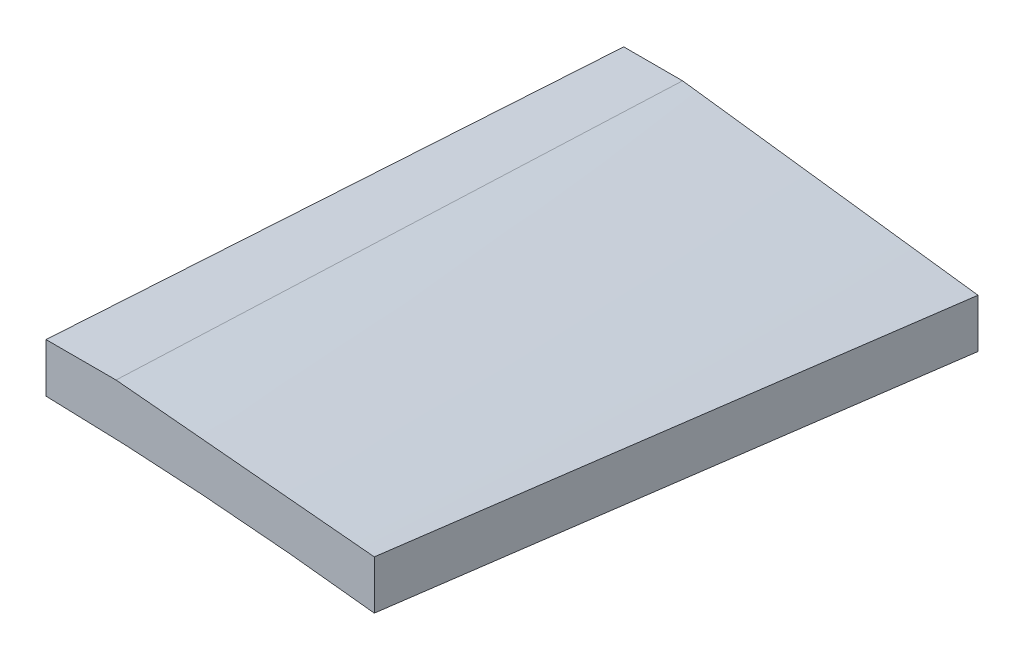
ISO-10303-21;
HEADER;
FILE_DESCRIPTION(('STEP AP214'),'2;1');
FILE_NAME('part.step','',(''),(''),'','','');
FILE_SCHEMA(('AUTOMOTIVE_DESIGN { 1 0 10303 214 1 1 1 1 }'));
ENDSEC;
DATA;
#1=APPLICATION_CONTEXT('core data for automotive mechanical design processes');
#2=APPLICATION_PROTOCOL_DEFINITION('international standard','automotive_design',2000,#1);
#3=PRODUCT_CONTEXT('',#1,'mechanical');
#4=PRODUCT('Part','Part','',(#3));
#5=PRODUCT_RELATED_PRODUCT_CATEGORY('part','',(#4));
#6=PRODUCT_DEFINITION_FORMATION('','',#4);
#7=PRODUCT_DEFINITION_CONTEXT('part definition',#1,'design');
#8=PRODUCT_DEFINITION('design','',#6,#7);
#9=PRODUCT_DEFINITION_SHAPE('','',#8);
#10=(LENGTH_UNIT() NAMED_UNIT(*) SI_UNIT(.MILLI.,.METRE.));
#11=(NAMED_UNIT(*) PLANE_ANGLE_UNIT() SI_UNIT($,.RADIAN.));
#12=(NAMED_UNIT(*) SI_UNIT($,.STERADIAN.) SOLID_ANGLE_UNIT());
#13=UNCERTAINTY_MEASURE_WITH_UNIT(LENGTH_MEASURE(1.E-05),#10,'distance_accuracy_value','');
#14=(GEOMETRIC_REPRESENTATION_CONTEXT(3) GLOBAL_UNCERTAINTY_ASSIGNED_CONTEXT((#13)) GLOBAL_UNIT_ASSIGNED_CONTEXT((#10,
#11,#12)) REPRESENTATION_CONTEXT('',''));
#15=CARTESIAN_POINT('',(0.,0.,0.));
#16=DIRECTION('',(0.,0.,1.));
#17=DIRECTION('',(1.,0.,0.));
#18=AXIS2_PLACEMENT_3D('',#15,#16,#17);
#19=CARTESIAN_POINT('',(122.012987748225,6.34998004884585,335.28));
#20=DIRECTION('',(1.,0.,0.));
#21=DIRECTION('',(0.,1.,0.));
#22=AXIS2_PLACEMENT_3D('',#19,#20,#21);
#23=PLANE('',#22);
#24=CARTESIAN_POINT('',(122.012987748225,42.2689138855518,619.759999999985));
#25=CARTESIAN_POINT('',(122.012987748225,43.0449286767758,631.613383838207));
#26=CARTESIAN_POINT('',(122.012987748225,43.8211244635662,643.466755827629));
#27=CARTESIAN_POINT('',(122.012987748225,45.373895579959,667.173474933267));
#28=CARTESIAN_POINT('',(122.012987748225,46.150470909561,679.026822049482));
#29=CARTESIAN_POINT('',(122.012987748225,47.7040186650179,702.733490260003));
#30=CARTESIAN_POINT('',(122.012987748225,48.4809910908729,714.586811354309));
#31=CARTESIAN_POINT('',(122.012987748225,50.0353507213848,738.293426360589));
#32=CARTESIAN_POINT('',(122.012987748225,50.8127379260422,750.146720272562));
#33=CARTESIAN_POINT('',(122.012987748225,51.5903413605131,762.));
#34=B_SPLINE_CURVE_WITH_KNOTS('',3,(#24,#25,#26,#27,#28,#29,#30,#31,#32,#33),.UNSPECIFIED.,.F.,
.F.,(4,2,2,2,4),(0.,35.6362759882764,71.2725519365494,106.90882788571,142.545103874873),.UNSPECIFIED.);
#35=CARTESIAN_POINT('',(122.012987748225,42.2689138855518,619.759999999985));
#36=VERTEX_POINT('',#35);
#37=CARTESIAN_POINT('',(122.012985594409,51.5902087951168,762.));
#38=VERTEX_POINT('',#37);
#39=EDGE_CURVE('E104',#36,#38,#34,.T.);
#40=ORIENTED_EDGE('',*,*,#39,.T.);
#41=DIRECTION('',(0.,1.,0.));
#42=VECTOR('',#41,1.);
#43=CARTESIAN_POINT('',(122.012987748225,51.6460530017887,762.));
#44=LINE('',#43,#42);
#45=CARTESIAN_POINT('',(122.012987748225,63.6548897190744,762.));
#46=VERTEX_POINT('',#45);
#47=EDGE_CURVE('E107',#38,#46,#44,.T.);
#48=ORIENTED_EDGE('',*,*,#47,.T.);
#49=CARTESIAN_POINT('',(122.012987748225,63.6548897190743,761.999999999999));
#50=CARTESIAN_POINT('',(122.012987748225,62.6352649018501,745.364551576616));
#51=CARTESIAN_POINT('',(122.012987748225,61.6160439518045,728.729078401939));
#52=CARTESIAN_POINT('',(122.012987748225,59.5783642213013,695.458085396377));
#53=CARTESIAN_POINT('',(122.012987748225,58.5599054408426,678.822565565492));
#54=CARTESIAN_POINT('',(122.012987748225,56.6762901019862,648.044698096347));
#55=CARTESIAN_POINT('',(122.012987748225,55.811034192517,633.902356538365));
#56=CARTESIAN_POINT('',(122.012987748225,54.9460232350253,619.759999999985));
#57=B_SPLINE_CURVE_WITH_KNOTS('',3,(#49,#50,#51,#52,#53,#54,#55,#56),.UNSPECIFIED.,.F.,.F.,(4,2,
2,4),(0.,50.0000001023951,100.00000013542,142.50635768178),.UNSPECIFIED.);
#58=CARTESIAN_POINT('',(122.012987748225,54.9460232350253,619.759999999985));
#59=VERTEX_POINT('',#58);
#60=EDGE_CURVE('E92',#46,#59,#57,.T.);
#61=ORIENTED_EDGE('',*,*,#60,.T.);
#62=DIRECTION('',(0.,-1.,0.));
#63=VECTOR('',#62,1.);
#64=CARTESIAN_POINT('',(122.012987748225,0.,619.76));
#65=LINE('',#64,#63);
#66=EDGE_CURVE('E51',#59,#36,#65,.T.);
#67=ORIENTED_EDGE('',*,*,#66,.T.);
#68=EDGE_LOOP('',(#40,#48,#61,#67));
#69=FACE_BOUND('',#68,.T.);
#70=ADVANCED_FACE('F44',(#69),#23,.F.);
#71=CARTESIAN_POINT('',(0.,0.,619.76));
#72=DIRECTION('',(0.,0.,-1.));
#73=DIRECTION('',(-1.,0.,0.));
#74=AXIS2_PLACEMENT_3D('',#71,#72,#73);
#75=PLANE('',#74);
#76=CARTESIAN_POINT('',(122.012987748225,42.2689138855527,619.76));
#77=CARTESIAN_POINT('',(124.448241517671,42.1643767634276,619.76));
#78=CARTESIAN_POINT('',(126.882756849898,42.0438117710736,619.76));
#79=CARTESIAN_POINT('',(130.532827965172,41.8416953269316,619.76));
#80=CARTESIAN_POINT('',(131.748974807422,41.7707957864617,619.76));
#81=CARTESIAN_POINT('',(134.180864283447,41.6223601715288,619.76));
#82=CARTESIAN_POINT('',(135.396606916646,41.5448240876751,619.76));
#83=CARTESIAN_POINT('',(137.827325774478,41.3835929566903,619.76));
#84=CARTESIAN_POINT('',(139.042302119273,41.2998997180211,619.76));
#85=CARTESIAN_POINT('',(141.471841549765,41.1267282823664,619.76));
#86=CARTESIAN_POINT('',(142.686404635555,41.0372500866874,619.76));
#87=CARTESIAN_POINT('',(145.11488810786,40.8530114004872,619.76));
#88=CARTESIAN_POINT('',(146.328808573915,40.7582519561394,619.76));
#89=CARTESIAN_POINT('',(148.756268627971,40.5639758433482,619.76));
#90=CARTESIAN_POINT('',(149.969808215908,40.4644591741015,619.76));
#91=CARTESIAN_POINT('',(152.3963259651,40.2606522922155,619.76));
#92=CARTESIAN_POINT('',(153.609304179194,40.1563627089267,619.76));
#93=CARTESIAN_POINT('',(156.034834509922,39.9429445186549,619.76));
#94=CARTESIAN_POINT('',(157.247386626677,39.8338159130428,619.76));
#95=CARTESIAN_POINT('',(159.671962879002,39.610691255984,619.76));
#96=CARTESIAN_POINT('',(160.883987043973,39.4966955240975,619.76));
#97=CARTESIAN_POINT('',(163.307559130601,39.2637465944752,619.76));
#98=CARTESIAN_POINT('',(164.519107052186,39.1447933959834,619.76));
#99=CARTESIAN_POINT('',(166.941648698677,38.9018173315685,619.76));
#100=CARTESIAN_POINT('',(168.152642442773,38.7777946571532,619.76));
#101=CARTESIAN_POINT('',(170.574085315804,38.5245531442786,619.76));
#102=CARTESIAN_POINT('',(171.784534444878,38.3953343071575,619.76));
#103=CARTESIAN_POINT('',(175.415200716581,37.9997483867404,619.76));
#104=CARTESIAN_POINT('',(177.834561667416,37.7254694276855,619.76));
#105=CARTESIAN_POINT('',(181.462014219506,37.2990805125503,619.76));
#106=CARTESIAN_POINT('',(182.670991607541,37.1544442927972,619.76));
#107=CARTESIAN_POINT('',(185.088355361681,36.8603131262002,619.76));
#108=CARTESIAN_POINT('',(186.296741727862,36.7108181799761,619.76));
#109=CARTESIAN_POINT('',(189.921541429177,36.2552975464865,619.76));
#110=CARTESIAN_POINT('',(192.337081572201,35.9422966200059,619.76));
#111=CARTESIAN_POINT('',(195.959031665217,35.4602093026612,619.76));
#112=CARTESIAN_POINT('',(197.166282190393,35.2973933779906,619.76));
#113=CARTESIAN_POINT('',(199.580237180211,34.96775571681,619.76));
#114=CARTESIAN_POINT('',(200.786941644819,34.8009339800481,619.76));
#115=CARTESIAN_POINT('',(203.200168126187,34.4633045975705,619.76));
#116=CARTESIAN_POINT('',(204.406689974741,34.2924957503763,619.76));
#117=CARTESIAN_POINT('',(206.819182070088,33.9470314127565,619.76));
#118=CARTESIAN_POINT('',(208.025152317248,33.7723759248858,619.76));
#119=CARTESIAN_POINT('',(209.23084733782,33.595842069036,619.76));
#120=B_SPLINE_CURVE_WITH_KNOTS('',3,(#76,#77,#78,#79,#80,#81,#82,#83,#84,#85,#86,#87,#88,#89,
#90,#91,#92,#93,#94,#95,#96,#97,#98,#99,#100,#101,#102,#103,#104,#105,#106,#107,#108,#109,#110,
#111,#112,#113,#114,#115,#116,#117,#118,#119),.UNSPECIFIED.,.F.,.F.,(4,2,2,2,2,2,2,2,2,2,2,2,2,
2,2,2,2,2,2,2,2,4),(0.,7.31235704427351,10.9669728743561,14.6215938758074,18.275145705317,
21.9286967096633,25.5815265292785,29.2343569656651,32.886707124308,36.5390562481721,
40.1911659380679,43.8432761850205,47.4952485948345,51.1472200642427,58.4516908415903,
62.1044786405917,65.7572659736222,73.0643926505828,76.7189284709772,80.3734645211136,
84.0291164232771,87.6847658975796),.UNSPECIFIED.);
#121=CARTESIAN_POINT('',(209.230847337816,33.5958420690439,619.760000000093));
#122=VERTEX_POINT('',#121);
#123=EDGE_CURVE('E113',#36,#122,#120,.T.);
#124=ORIENTED_EDGE('',*,*,#123,.F.);
#125=ORIENTED_EDGE('',*,*,#66,.F.);
#126=DIRECTION('',(-1.,0.,0.));
#127=VECTOR('',#126,1.);
#128=CARTESIAN_POINT('',(111.489886899315,54.9460232350262,619.76));
#129=LINE('',#128,#127);
#130=CARTESIAN_POINT('',(136.489886899315,54.9460232350262,619.76));
#131=VERTEX_POINT('',#130);
#132=EDGE_CURVE('E101',#131,#59,#129,.T.);
#133=ORIENTED_EDGE('',*,*,#132,.F.);
#134=CARTESIAN_POINT('',(209.230847337821,45.5958420690359,619.76));
#135=CARTESIAN_POINT('',(201.586387683056,46.5784670200576,619.76));
#136=CARTESIAN_POINT('',(193.941928028292,47.5610919710792,619.76));
#137=CARTESIAN_POINT('',(177.996204794492,49.610767974255,619.76));
#138=CARTESIAN_POINT('',(169.694941215457,50.6778190264092,619.76));
#139=CARTESIAN_POINT('',(153.092414057386,52.8119211307177,619.76));
#140=CARTESIAN_POINT('',(144.791150478351,53.878972182872,619.76));
#141=CARTESIAN_POINT('',(136.489886899315,54.9460232350262,619.76));
#142=B_SPLINE_CURVE_WITH_KNOTS('',3,(#134,#135,#136,#137,#138,#139,#140,#141),.UNSPECIFIED.,.F.,
.F.,(4,2,2,4),(0.,23.1220638540164,48.2307510878943,73.3394383217721),.UNSPECIFIED.);
#143=CARTESIAN_POINT('',(209.230847337816,45.5958420690439,619.760000000093));
#144=VERTEX_POINT('',#143);
#145=EDGE_CURVE('E185',#144,#131,#142,.T.);
#146=ORIENTED_EDGE('',*,*,#145,.F.);
#147=DIRECTION('',(0.,1.,0.));
#148=VECTOR('',#147,1.);
#149=CARTESIAN_POINT('',(209.230847335755,9.36643436036436,619.76));
#150=LINE('',#149,#148);
#151=EDGE_CURVE('E121',#122,#144,#150,.T.);
#152=ORIENTED_EDGE('',*,*,#151,.F.);
#153=EDGE_LOOP('',(#124,#125,#133,#146,#152));
#154=FACE_BOUND('',#153,.T.);
#155=ADVANCED_FACE('F141',(#154),#75,.T.);
#156=CARTESIAN_POINT('',(130.956058059283,37.574856415899,335.28));
#157=CARTESIAN_POINT('',(133.722938387168,46.2481983373047,477.52169947526));
#158=CARTESIAN_POINT('',(136.489876885067,54.9368025875343,619.762103902452));
#159=CARTESIAN_POINT('',(139.256928095494,63.6548897190744,762.));
#160=CARTESIAN_POINT('',(126.789391392616,37.5748564158991,335.28));
#161=CARTESIAN_POINT('',(129.556271720501,46.2481983373047,477.52169947526));
#162=CARTESIAN_POINT('',(132.3232102184,54.9368025875343,619.762103902452));
#163=CARTESIAN_POINT('',(135.090261428827,63.6548897190744,762.));
#164=CARTESIAN_POINT('',(118.456058059283,37.574856415899,335.28));
#165=CARTESIAN_POINT('',(121.222938387168,46.2481983373047,477.52169947526));
#166=CARTESIAN_POINT('',(123.989876885067,54.9368025875344,619.762103902452));
#167=CARTESIAN_POINT('',(126.756928095494,63.6548897190745,762.000000000001));
#168=CARTESIAN_POINT('',(105.956058059283,37.5748564158991,335.28));
#169=CARTESIAN_POINT('',(108.722938387168,46.2481983373046,477.52169947526));
#170=CARTESIAN_POINT('',(111.489876885067,54.9368025875342,619.762103902451));
#171=CARTESIAN_POINT('',(114.256928095494,63.6548897190743,761.999999999999));
#172=CARTESIAN_POINT('',(93.4560580592829,37.574856415899,335.28));
#173=CARTESIAN_POINT('',(96.222938387168,46.2481983373047,477.52169947526));
#174=CARTESIAN_POINT('',(98.989876885067,54.9368025875343,619.762103902452));
#175=CARTESIAN_POINT('',(101.756928095494,63.6548897190744,762.));
#176=CARTESIAN_POINT('',(85.1227247259497,37.574856415899,335.28));
#177=CARTESIAN_POINT('',(87.8896050538347,46.2481983373046,477.52169947526));
#178=CARTESIAN_POINT('',(90.6565435517336,54.9368025875343,619.762103902452));
#179=CARTESIAN_POINT('',(93.4235947621608,63.6548897190744,762.));
#180=CARTESIAN_POINT('',(80.956058059283,37.5748564158991,335.28));
#181=CARTESIAN_POINT('',(83.722938387168,46.2481983373047,477.52169947526));
#182=CARTESIAN_POINT('',(86.489876885067,54.9368025875343,619.762103902452));
#183=CARTESIAN_POINT('',(89.2569280954942,63.6548897190744,762.));
#184=B_SPLINE_SURFACE_WITH_KNOTS('',3,3,((#156,#157,#158,#159),(#160,#161,#162,#163),(#164,#165,
#166,#167),(#168,#169,#170,#171),(#172,#173,#174,#175),(#176,#177,#178,#179),(#180,#181,#182,
#183)),.UNSPECIFIED.,.F.,.F.,.F.,(4,1,1,1,4),(4,4),(0.19667758886926,0.224376205647247,
0.252074822425234,0.279773439203221,0.307472055981208),(0.,1.),.UNSPECIFIED.);
#185=CARTESIAN_POINT('',(130.956058059283,37.574856415899,335.28));
#186=CARTESIAN_POINT('',(133.722938387168,46.2481983373047,477.52169947526));
#187=CARTESIAN_POINT('',(136.489876885067,54.9368025875343,619.762103902452));
#188=CARTESIAN_POINT('',(139.256928095494,63.6548897190744,762.));
#189=B_SPLINE_CURVE_WITH_KNOTS('',3,(#185,#186,#187,#188),.UNSPECIFIED.,.F.,.F.,(4,4),(0.,1.),.UNSPECIFIED.);
#190=CARTESIAN_POINT('',(139.256928095494,63.6548897190744,762.));
#191=VERTEX_POINT('',#190);
#192=EDGE_CURVE('E58',#131,#191,#189,.T.);
#193=DIRECTION('',(-1.,0.,0.));
#194=VECTOR('',#193,1.);
#195=CARTESIAN_POINT('',(89.2569280954942,63.6548897190744,762.));
#196=LINE('',#195,#194);
#197=EDGE_CURVE('E97',#191,#46,#196,.T.);
#198=ORIENTED_EDGE('',*,*,#192,.F.);
#199=ORIENTED_EDGE('',*,*,#132,.T.);
#200=ORIENTED_EDGE('',*,*,#60,.F.);
#201=ORIENTED_EDGE('',*,*,#197,.F.);
#202=EDGE_LOOP('',(#198,#199,#200,#201));
#203=FACE_BOUND('',#202,.T.);
#204=ADVANCED_FACE('F95',(#203),#184,.T.);
#205=CARTESIAN_POINT('',(111.477492972876,51.6460530017887,762.));
#206=DIRECTION('',(0.,0.,1.));
#207=DIRECTION('',(1.,0.,0.));
#208=AXIS2_PLACEMENT_3D('',#205,#206,#207);
#209=PLANE('',#208);
#210=ORIENTED_EDGE('',*,*,#47,.F.);
#211=CARTESIAN_POINT('',(24.9991434170329,31.0964008470047,762.));
#212=CARTESIAN_POINT('',(24.9991434170329,32.8522185997555,762.));
#213=CARTESIAN_POINT('',(27.4179385280924,35.8883177815517,762.));
#214=CARTESIAN_POINT('',(31.7474246399989,38.6970957891555,762.));
#215=CARTESIAN_POINT('',(36.9114443605116,41.1010380531441,762.));
#216=CARTESIAN_POINT('',(43.0205983099712,43.196106756929,762.));
#217=CARTESIAN_POINT('',(51.0869016729065,45.5261244373149,762.));
#218=CARTESIAN_POINT('',(61.2202621419313,47.6426880304369,762.));
#219=CARTESIAN_POINT('',(73.4103767098064,49.4367454088579,762.));
#220=CARTESIAN_POINT('',(85.5960193607886,50.65493632377,762.));
#221=CARTESIAN_POINT('',(101.842445598241,51.6369772628706,762.));
#222=CARTESIAN_POINT('',(122.19115115007,51.779158438112,762.));
#223=CARTESIAN_POINT('',(146.602283798461,50.7988495791154,762.));
#224=CARTESIAN_POINT('',(171.032045292284,49.130515531749,762.));
#225=CARTESIAN_POINT('',(189.770245111766,47.2530528113811,762.));
#226=CARTESIAN_POINT('',(200.370541836645,46.0279905449402,762.));
#227=CARTESIAN_POINT('',(202.839777129521,45.7338764691475,762.));
#228=B_SPLINE_CURVE_WITH_KNOTS('',3,(#211,#212,#213,#214,#215,#216,#217,#218,#219,#220,#221,
#222,#223,#224,#225,#226,#227),.UNSPECIFIED.,.F.,.F.,(4,1,1,1,1,1,1,1,1,1,1,1,1,1,4),
(0.498396826463848,0.509775276169533,0.5171599878226,0.530632991056939,0.543549577577208,
0.556240821475834,0.581224600668469,0.6059481928375,0.630547770922518,0.655086674698896,
0.704122821890936,0.753234226035596,0.802458299876464,0.851833076582463,0.866835397644884),.UNSPECIFIED.);
#229=CARTESIAN_POINT('',(202.839777129521,45.7338764691475,762.));
#230=VERTEX_POINT('',#229);
#231=EDGE_CURVE('E216',#38,#230,#228,.T.);
#232=ORIENTED_EDGE('',*,*,#231,.T.);
#233=DIRECTION('',(0.,1.,0.));
#234=VECTOR('',#233,1.);
#235=CARTESIAN_POINT('',(202.839777129521,45.7338764691475,762.));
#236=LINE('',#235,#234);
#237=CARTESIAN_POINT('',(202.839777129521,57.7338764691475,762.));
#238=VERTEX_POINT('',#237);
#239=EDGE_CURVE('E213',#230,#238,#236,.T.);
#240=ORIENTED_EDGE('',*,*,#239,.T.);
#241=DIRECTION('',(-0.995692069752838,0.0927216384201145,0.));
#242=VECTOR('',#241,1.);
#243=CARTESIAN_POINT('',(139.256928095494,63.6548897190744,762.));
#244=LINE('',#243,#242);
#245=EDGE_CURVE('E118',#238,#191,#244,.T.);
#246=ORIENTED_EDGE('',*,*,#245,.T.);
#247=ORIENTED_EDGE('',*,*,#197,.T.);
#248=EDGE_LOOP('',(#210,#232,#240,#246,#247));
#249=FACE_BOUND('',#248,.T.);
#250=ADVANCED_FACE('F116',(#249),#209,.T.);
#251=CARTESIAN_POINT('',(222.012987748225,21.3664343603644,335.28));
#252=CARTESIAN_POINT('',(215.621841191138,33.4689125503059,477.52169947526));
#253=CARTESIAN_POINT('',(209.230752804065,45.5866530690714,619.762103902452));
#254=CARTESIAN_POINT('',(202.839777129521,57.7338764691475,762.));
#255=CARTESIAN_POINT('',(214.424910274146,22.7171361983256,335.28));
#256=CARTESIAN_POINT('',(208.796932624141,34.5338530325558,477.52169947526));
#257=CARTESIAN_POINT('',(203.169013144149,46.36583219561,619.762103902452));
#258=CARTESIAN_POINT('',(197.541206376685,58.2272942399747,762.));
#259=CARTESIAN_POINT('',(199.24875532599,25.418539874248,335.28));
#260=CARTESIAN_POINT('',(195.147115490146,36.6637339970556,477.52169947526));
#261=CARTESIAN_POINT('',(191.045533824316,47.9241904486871,619.762103902452));
#262=CARTESIAN_POINT('',(186.944064871014,59.2141297816292,762.));
#263=CARTESIAN_POINT('',(176.484522903754,29.4706453881317,335.28));
#264=CARTESIAN_POINT('',(174.672389789153,39.8585554438053,477.52169947526));
#265=CARTESIAN_POINT('',(172.860314844566,50.2617278283029,619.762103902452));
#266=CARTESIAN_POINT('',(171.048352612508,60.694383094111,762.000000000001));
#267=CARTESIAN_POINT('',(153.720290481519,33.5227509020154,335.28));
#268=CARTESIAN_POINT('',(154.197664088161,43.053376890555,477.52169947526));
#269=CARTESIAN_POINT('',(154.675095864817,52.5992652079185,619.762103902451));
#270=CARTESIAN_POINT('',(155.152640354001,62.1746364065926,761.999999999999));
#271=CARTESIAN_POINT('',(138.544135533361,36.2241545779378,335.28));
#272=CARTESIAN_POINT('',(140.547846954166,45.1832578550548,477.52169947526));
#273=CARTESIAN_POINT('',(142.551616544983,54.1576234609957,619.762103902452));
#274=CARTESIAN_POINT('',(144.55549884833,63.1614719482472,762.));
#275=CARTESIAN_POINT('',(130.956058059283,37.574856415899,335.28));
#276=CARTESIAN_POINT('',(133.722938387168,46.2481983373047,477.52169947526));
#277=CARTESIAN_POINT('',(136.489876885067,54.9368025875343,619.762103902452));
#278=CARTESIAN_POINT('',(139.256928095494,63.6548897190744,762.));
#279=B_SPLINE_SURFACE_WITH_KNOTS('',3,3,((#251,#252,#253,#254),(#255,#256,#257,#258),(#259,#260,
#261,#262),(#263,#264,#265,#266),(#267,#268,#269,#270),(#271,#272,#273,#274),(#275,#276,#277,
#278)),.UNSPECIFIED.,.F.,.F.,.F.,(4,1,1,1,4),(4,4),(0.0265906721068675,0.0691124012974655,
0.111634130488064,0.154155859678662,0.19667758886926),(0.,1.),.UNSPECIFIED.);
#280=CARTESIAN_POINT('',(222.012987748225,21.3664343603644,335.28));
#281=CARTESIAN_POINT('',(215.621841191138,33.4689125503059,477.52169947526));
#282=CARTESIAN_POINT('',(209.230752804065,45.5866530690714,619.762103902452));
#283=CARTESIAN_POINT('',(202.839777129521,57.7338764691475,762.));
#284=B_SPLINE_CURVE_WITH_KNOTS('',3,(#280,#281,#282,#283),.UNSPECIFIED.,.F.,.F.,(4,4),(0.,1.),.UNSPECIFIED.);
#285=EDGE_CURVE('E11',#144,#238,#284,.T.);
#286=ORIENTED_EDGE('',*,*,#285,.F.);
#287=ORIENTED_EDGE('',*,*,#145,.T.);
#288=ORIENTED_EDGE('',*,*,#192,.T.);
#289=ORIENTED_EDGE('',*,*,#245,.F.);
#290=EDGE_LOOP('',(#286,#287,#288,#289));
#291=FACE_BOUND('',#290,.T.);
#292=ADVANCED_FACE('F168',(#291),#279,.T.);
#293=CARTESIAN_POINT('',(9.29077044004429E-07,6.34998004884775,335.28));
#294=CARTESIAN_POINT('',(8.33297207421032,14.5787844685806,477.52169947526));
#295=CARTESIAN_POINT('',(16.6660013893575,22.8228512171374,619.762103902452));
#296=CARTESIAN_POINT('',(24.9991434170329,31.0964008470047,762.));
#297=CARTESIAN_POINT('',(9.29077600369592E-07,7.45438325082316,335.28));
#298=CARTESIAN_POINT('',(8.33297207421069,15.6111681299376,477.52169947526));
#299=CARTESIAN_POINT('',(16.6660013893577,23.783215337876,619.762103902452));
#300=CARTESIAN_POINT('',(24.9991434170329,31.9847454271249,762.));
#301=CARTESIAN_POINT('',(0.969916519496457,9.6613167038059,335.28));
#302=CARTESIAN_POINT('',(9.22997388777417,17.6892352496878,477.521699475259));
#303=CARTESIAN_POINT('',(17.4900894260658,25.7324161243937,619.762103902451));
#304=CARTESIAN_POINT('',(25.7503176768857,33.8050798804101,762.));
#305=CARTESIAN_POINT('',(3.44848156516794,12.0366302116868,335.28));
#306=CARTESIAN_POINT('',(11.5121687647093,19.9379477005165,477.52169947526));
#307=CARTESIAN_POINT('',(19.5759141342645,27.8545275181702,619.762103902452));
#308=CARTESIAN_POINT('',(27.639772216348,35.8005902171344,762.000000000001));
#309=CARTESIAN_POINT('',(5.45941166538086,13.4428022435293,335.28));
#310=CARTESIAN_POINT('',(13.3630371949687,21.2745392258276,477.521699475259));
#311=CARTESIAN_POINT('',(21.2667208945703,29.1215385369498,619.762103902452));
#312=CARTESIAN_POINT('',(29.1705173067003,36.9980207293825,762.));
#313=CARTESIAN_POINT('',(6.98203766683405,14.316970710559,335.28));
#314=CARTESIAN_POINT('',(14.7696273274846,22.112594899526,477.52169947526));
#315=CARTESIAN_POINT('',(22.557275158149,29.923481417317,619.762103902452));
#316=CARTESIAN_POINT('',(30.3450357013417,37.7638508164184,762.));
#317=CARTESIAN_POINT('',(8.54472942418297,15.0888371575498,335.28));
#318=CARTESIAN_POINT('',(16.217370772052,22.8607836546203,477.52169947526));
#319=CARTESIAN_POINT('',(23.8900702899349,30.6479924805147,619.762103902452));
#320=CARTESIAN_POINT('',(31.5628825203461,38.4646841877197,762.));
#321=CARTESIAN_POINT('',(10.1582127248828,15.8184229079955,335.28));
#322=CARTESIAN_POINT('',(17.7118720922566,23.5698254554367,477.521699475259));
#323=CARTESIAN_POINT('',(25.2655896296443,31.3364903317018,619.762103902451));
#324=CARTESIAN_POINT('',(32.8194198795603,39.1326380892775,761.999999999999));
#325=CARTESIAN_POINT('',(11.8098506399446,16.4960217707987,335.28));
#326=CARTESIAN_POINT('',(19.2427460811811,24.2313837922629,477.521699475261));
#327=CARTESIAN_POINT('',(26.6756996924314,31.9820081425512,619.762103902453));
#328=CARTESIAN_POINT('',(34.1087660162101,39.76211537415,762.000000000002));
#329=CARTESIAN_POINT('',(13.4900691645311,17.1289319071832,335.28));
#330=CARTESIAN_POINT('',(20.801220906549,24.8518102555458,477.521699475259));
#331=CARTESIAN_POINT('',(28.1124308185809,32.5899509327323,619.762103902451));
#332=CARTESIAN_POINT('',(35.423753443141,40.3575744912294,761.999999999999));
#333=CARTESIAN_POINT('',(15.1903900958544,17.7169000721208,335.28));
#334=CARTESIAN_POINT('',(22.3776261706481,25.4304482833263,477.52169947526));
#335=CARTESIAN_POINT('',(29.5649204154557,33.1592588233557,619.762103902452));
#336=CARTESIAN_POINT('',(36.7523273727916,40.9175522446957,761.999999999999));
#337=CARTESIAN_POINT('',(17.465921328655,18.443907318319,335.28));
#338=CARTESIAN_POINT('',(24.4893873514633,26.1494155039185,477.52169947526));
#339=CARTESIAN_POINT('',(31.5129115442856,33.870186018342,619.762103902453));
#340=CARTESIAN_POINT('',(38.5365484496361,41.620439414076,762.000000000001));
#341=CARTESIAN_POINT('',(20.3261253650035,19.2567063001384,335.28));
#342=CARTESIAN_POINT('',(27.1442798687524,26.9590316546654,477.521699475259));
#343=CARTESIAN_POINT('',(33.9624925425152,34.6766193380163,619.76210390245));
#344=CARTESIAN_POINT('',(40.7808179288063,42.4236899026778,761.999999999998));
#345=CARTESIAN_POINT('',(23.7782685903277,20.118367205322,335.28));
#346=CARTESIAN_POINT('',(30.3520648212409,27.826403434635,477.52169947526));
#347=CARTESIAN_POINT('',(36.9259192221679,35.549701992772,619.762103902453));
#348=CARTESIAN_POINT('',(43.4998863356233,43.3024834322195,762.000000000001));
#349=CARTESIAN_POINT('',(27.2569743923509,20.9064140542042,335.28));
#350=CARTESIAN_POINT('',(33.5853102584017,28.6257194399167,477.52169947526));
#351=CARTESIAN_POINT('',(39.9137042944664,36.3602871544532,619.762103902451));
#352=CARTESIAN_POINT('',(46.2422110430595,44.1243377503001,761.999999999999));
#353=CARTESIAN_POINT('',(30.7542530905361,21.6165466303187,335.279999999999));
#354=CARTESIAN_POINT('',(36.8375774721128,29.3523453451718,477.521699475259));
#355=CARTESIAN_POINT('',(42.9209600237033,37.103406388849,619.762103902451));
#356=CARTESIAN_POINT('',(49.0044552878221,44.8839503138367,762.));
#357=CARTESIAN_POINT('',(34.2664636940487,22.2460759079554,335.280000000001));
#358=CARTESIAN_POINT('',(40.1050244166742,30.0039988320751,477.52169947526));
#359=CARTESIAN_POINT('',(45.9436433093136,37.7771840850187,619.762103902452));
#360=CARTESIAN_POINT('',(51.7823749144814,45.579852219273,762.));
#361=CARTESIAN_POINT('',(37.7902260736038,22.8004936568621,335.279999999999));
#362=CARTESIAN_POINT('',(43.384705041758,30.5859470440672,477.521699475259));
#363=CARTESIAN_POINT('',(48.979242179926,38.3866627600962,619.762103902451));
#364=CARTESIAN_POINT('',(54.5738920306224,46.2168613574358,761.999999999999));
#365=CARTESIAN_POINT('',(41.3242497765985,23.2878811261495,335.28));
#366=CARTESIAN_POINT('',(46.675131793767,31.1056757552862,477.52169947526));
#367=CARTESIAN_POINT('',(52.0260719809494,38.9387327132469,619.762103902453));
#368=CARTESIAN_POINT('',(57.3771248806601,46.8012725525181,762.000000000001));
#369=CARTESIAN_POINT('',(44.8658239828752,23.7149223381359,335.28));
#370=CARTESIAN_POINT('',(49.9736457372606,31.5693936302263,477.521699475259));
#371=CARTESIAN_POINT('',(55.0815256616599,39.4391272511406,619.762103902451));
#372=CARTESIAN_POINT('',(60.1895182985876,47.3383437533655,761.999999999999));
#373=CARTESIAN_POINT('',(48.4136829142244,24.0896238833925,335.28));
#374=CARTESIAN_POINT('',(53.2790352364492,31.9845911908484,477.52169947526));
#375=CARTESIAN_POINT('',(58.144445728688,39.8948208271283,619.762103902453));
#376=CARTESIAN_POINT('',(63.009968933455,47.8345333447187,762.000000000001));
#377=CARTESIAN_POINT('',(53.1486242463732,24.5260190039242,335.28));
#378=CARTESIAN_POINT('',(57.6912752508218,32.4792550117327,477.521699475259));
#379=CARTESIAN_POINT('',(62.2339844252844,40.4477533483652,619.762103902451));
#380=CARTESIAN_POINT('',(66.7768063122753,48.4457345663082,761.999999999999));
#381=CARTESIAN_POINT('',(59.0789436792651,24.9574757661192,335.28));
#382=CARTESIAN_POINT('',(63.2200221820315,32.9915421905065,477.52169947526));
#383=CARTESIAN_POINT('',(67.3611588548119,41.0408709437178,619.762103902453));
#384=CARTESIAN_POINT('',(71.5024082401206,49.1196825782396,762.000000000001));
#385=CARTESIAN_POINT('',(66.2030814892412,25.3140522243183,335.28));
#386=CARTESIAN_POINT('',(69.8642211934628,33.4561192258002,477.52169947526));
#387=CARTESIAN_POINT('',(73.5254190676983,41.613448556106,619.762103902451));
#388=CARTESIAN_POINT('',(77.1867296544622,49.8002607677224,761.999999999999));
#389=CARTESIAN_POINT('',(73.3339674682549,25.523312736422,335.279999999999));
#390=CARTESIAN_POINT('',(76.5177056557658,33.7833803999775,477.52169947526));
#391=CARTESIAN_POINT('',(79.7015020132907,42.0587103923571,619.762103902452));
#392=CARTESIAN_POINT('',(82.8854110833438,50.3635232660471,762.000000000001));
#393=CARTESIAN_POINT('',(80.4669900342226,25.5957976291351,335.280000000001));
#394=CARTESIAN_POINT('',(83.1755672296286,33.9831036079315,477.52169947526));
#395=CARTESIAN_POINT('',(85.8842025950485,42.3856719155519,619.762103902451));
#396=CARTESIAN_POINT('',(88.5929506729966,50.8177231044828,761.999999999999));
#397=CARTESIAN_POINT('',(87.6002131526684,25.5406730290278,335.279999999999));
#398=CARTESIAN_POINT('',(89.8360561254533,34.0637012643954,477.521699475259));
#399=CARTESIAN_POINT('',(92.071957268252,42.6019918285869,619.762103902452));
#400=CARTESIAN_POINT('',(94.3079711235791,51.1697652740891,762.));
#401=CARTESIAN_POINT('',(94.731344048156,25.3623320865792,335.28));
#402=CARTESIAN_POINT('',(96.4968287829496,34.0292359395454,477.52169947526));
#403=CARTESIAN_POINT('',(98.262371687757,42.7114021213355,619.762103902453));
#404=CARTESIAN_POINT('',(100.028027305093,51.4230511844363,762.000000000001));
#405=CARTESIAN_POINT('',(101.858719846003,25.0679177013017,335.28));
#406=CARTESIAN_POINT('',(103.156275912104,33.8864442696627,477.521699475259));
#407=CARTESIAN_POINT('',(104.453890148219,42.7202331668477,619.762103902451));
#408=CARTESIAN_POINT('',(105.751617096862,51.5835049453433,761.999999999999));
#409=CARTESIAN_POINT('',(108.98145520224,24.6671471282029,335.28));
#410=CARTESIAN_POINT('',(109.813353159231,33.6444202192184,477.52169947526));
#411=CARTESIAN_POINT('',(110.645309286237,42.6369556390579,619.762103902452));
#412=CARTESIAN_POINT('',(111.477378125771,51.6589739402079,762.));
#413=CARTESIAN_POINT('',(116.098371799005,24.1694505600281,335.28));
#414=CARTESIAN_POINT('',(116.466790352252,33.3119415656027,477.521699475259));
#415=CARTESIAN_POINT('',(116.835267075513,42.4696949000013,619.762103902452));
#416=CARTESIAN_POINT('',(117.203856511302,51.6569311157104,762.));
#417=CARTESIAN_POINT('',(123.208750062991,23.5842845444573,335.280000000001));
#418=CARTESIAN_POINT('',(123.115731295253,32.8978674091282,477.52169947526));
#419=CARTESIAN_POINT('',(123.022770697529,42.2267126026231,619.762103902452));
#420=CARTESIAN_POINT('',(122.929922812333,51.5850406774286,762.));
#421=CARTESIAN_POINT('',(130.310988961638,22.921250348438,335.279999999999));
#422=CARTESIAN_POINT('',(129.758512205833,32.411084966105,477.521699475259));
#423=CARTESIAN_POINT('',(129.206093620042,41.9161819125961,619.762103902451));
#424=CARTESIAN_POINT('',(128.65378774678,51.4507617403976,761.999999999999));
#425=CARTESIAN_POINT('',(137.406778455928,22.1873993770708,335.28));
#426=CARTESIAN_POINT('',(136.396633479512,31.8582341206284,477.52169947526));
#427=CARTESIAN_POINT('',(135.38654667311,41.54433119301,619.762103902452));
#428=CARTESIAN_POINT('',(134.376572579236,51.2599111467022,762.));
#429=CARTESIAN_POINT('',(144.494202314858,21.3909417632401,335.28));
#430=CARTESIAN_POINT('',(143.028083804604,31.2468918148837,477.521699475259));
#431=CARTESIAN_POINT('',(141.562023464364,41.1181041953513,619.762103902451));
#432=CARTESIAN_POINT('',(140.096075836652,51.0187994571294,761.999999999999));
#433=CARTESIAN_POINT('',(153.939247988962,20.2535758150893,335.280000000001));
#434=CARTESIAN_POINT('',(151.866994129968,30.3616126018442,477.52169947526));
#435=CARTESIAN_POINT('',(149.794798440988,40.4849117174231,619.762103902452));
#436=CARTESIAN_POINT('',(147.722715464536,50.6376937143126,762.));
#437=CARTESIAN_POINT('',(165.724997703164,18.7151343960646,335.279999999999));
#438=CARTESIAN_POINT('',(162.898490334251,29.1457414177919,477.521699475259));
#439=CARTESIAN_POINT('',(160.072041135351,39.5916107683432,619.762103902452));
#440=CARTESIAN_POINT('',(157.24570464898,50.066963000205,762.));
#441=CARTESIAN_POINT('',(179.846765687905,16.6757724994209,335.28));
#442=CARTESIAN_POINT('',(176.120250526412,27.5053845131493,477.52169947526));
#443=CARTESIAN_POINT('',(172.393793534932,38.3502588557017,619.762103902452));
#444=CARTESIAN_POINT('',(168.667449255981,49.2246160795646,762.));
#445=CARTESIAN_POINT('',(193.933550227643,14.4286098676329,335.28));
#446=CARTESIAN_POINT('',(189.313154974693,25.670161061974,477.52169947526));
#447=CARTESIAN_POINT('',(184.692817891756,36.926974585139,619.762103902452));
#448=CARTESIAN_POINT('',(180.072593521347,48.2132709896145,762.));
#449=CARTESIAN_POINT('',(207.990516041457,11.9899167572326,335.28));
#450=CARTESIAN_POINT('',(202.481883538507,23.6559759384714,477.52169947526));
#451=CARTESIAN_POINT('',(196.97330920557,35.3372974485342,619.762103902452));
#452=CARTESIAN_POINT('',(191.464847585162,47.0481018399075,762.));
#453=CARTESIAN_POINT('',(217.341938436305,10.2573401873864,335.28));
#454=CARTESIAN_POINT('',(211.244446134889,22.2133306080831,477.52169947526));
#455=CARTESIAN_POINT('',(205.147012003487,34.1845833576038,619.762103902452));
#456=CARTESIAN_POINT('',(199.049690584614,46.1853189884351,762.));
#457=CARTESIAN_POINT('',(222.012987748225,9.36643436036436,335.28));
#458=CARTESIAN_POINT('',(215.621841191138,21.4689125503059,477.52169947526));
#459=CARTESIAN_POINT('',(209.230752804065,33.5866530690714,619.762103902452));
#460=CARTESIAN_POINT('',(202.839777129521,45.7338764691475,762.));
#461=B_SPLINE_SURFACE_WITH_KNOTS('',3,3,((#293,#294,#295,#296),(#297,#298,#299,#300),(#301,#302,
#303,#304),(#305,#306,#307,#308),(#309,#310,#311,#312),(#313,#314,#315,#316),(#317,#318,#319,
#320),(#321,#322,#323,#324),(#325,#326,#327,#328),(#329,#330,#331,#332),(#333,#334,#335,#336),
(#337,#338,#339,#340),(#341,#342,#343,#344),(#345,#346,#347,#348),(#349,#350,#351,#352),(#353,
#354,#355,#356),(#357,#358,#359,#360),(#361,#362,#363,#364),(#365,#366,#367,#368),(#369,#370,
#371,#372),(#373,#374,#375,#376),(#377,#378,#379,#380),(#381,#382,#383,#384),(#385,#386,#387,
#388),(#389,#390,#391,#392),(#393,#394,#395,#396),(#397,#398,#399,#400),(#401,#402,#403,#404),
(#405,#406,#407,#408),(#409,#410,#411,#412),(#413,#414,#415,#416),(#417,#418,#419,#420),(#421,
#422,#423,#424),(#425,#426,#427,#428),(#429,#430,#431,#432),(#433,#434,#435,#436),(#437,#438,
#439,#440),(#441,#442,#443,#444),(#445,#446,#447,#448),(#449,#450,#451,#452),(#453,#454,#455,
#456),(#457,#458,#459,#460)),.UNSPECIFIED.,.F.,.F.,.F.,(4,1,1,1,1,1,1,1,1,1,1,1,1,1,1,1,1,1,1,1,
1,1,1,1,1,1,1,1,1,1,1,1,1,1,1,1,1,1,1,4),(4,4),(0.548393358469235,0.555449712243154,
0.562506066017072,0.566034242904031,0.56956241979099,0.573090596677949,0.576618773564908,
0.580146950451867,0.583675127338826,0.587203304225785,0.590731481112744,0.597787834886663,
0.604844188660581,0.611900542434499,0.618956896208417,0.626013249982335,0.633069603756254,
0.640125957530172,0.64718231130409,0.654238665078008,0.661295018851926,0.675407726399763,
0.689520433947599,0.703633141495436,0.717745849043272,0.731858556591108,0.745971264138945,
0.760083971686781,0.774196679234618,0.788309386782454,0.80242209433029,0.816534801878127,
0.830647509425963,0.8447602169738,0.858872924521636,0.887098339617309,0.915323754712982,
0.943549169808654,0.971774584904327,1.),(0.,1.),.UNSPECIFIED.);
#462=CARTESIAN_POINT('',(222.012987748225,9.36643436036436,335.28));
#463=CARTESIAN_POINT('',(215.621841191138,21.4689125503059,477.52169947526));
#464=CARTESIAN_POINT('',(209.230752804065,33.5866530690714,619.762103902452));
#465=CARTESIAN_POINT('',(202.839777129521,45.7338764691475,762.));
#466=B_SPLINE_CURVE_WITH_KNOTS('',3,(#462,#463,#464,#465),.UNSPECIFIED.,.F.,.F.,(4,4),(0.,1.),.UNSPECIFIED.);
#467=EDGE_CURVE('E209',#122,#230,#466,.T.);
#468=ORIENTED_EDGE('',*,*,#39,.F.);
#469=ORIENTED_EDGE('',*,*,#123,.T.);
#470=ORIENTED_EDGE('',*,*,#467,.T.);
#471=ORIENTED_EDGE('',*,*,#231,.F.);
#472=EDGE_LOOP('',(#468,#469,#470,#471));
#473=FACE_BOUND('',#472,.T.);
#474=ADVANCED_FACE('F46',(#473),#461,.T.);
#475=CARTESIAN_POINT('',(222.012987748225,9.36643436036436,335.28));
#476=DIRECTION('',(0.998992101682105,0.,0.0448863094581294));
#477=DIRECTION('',(0.,1.,0.));
#478=AXIS2_PLACEMENT_3D('',#475,#476,#477);
#479=PLANE('',#478);
#480=ORIENTED_EDGE('',*,*,#467,.F.);
#481=ORIENTED_EDGE('',*,*,#151,.T.);
#482=ORIENTED_EDGE('',*,*,#285,.T.);
#483=ORIENTED_EDGE('',*,*,#239,.F.);
#484=EDGE_LOOP('',(#480,#481,#482,#483));
#485=FACE_BOUND('',#484,.T.);
#486=ADVANCED_FACE('F142',(#485),#479,.T.);
#487=CLOSED_SHELL('',(#70,#155,#204,#250,#292,#474,#486));
#488=MANIFOLD_SOLID_BREP('B2',#487);
#489=ADVANCED_BREP_SHAPE_REPRESENTATION('',(#18,#488),#14);
#490=SHAPE_DEFINITION_REPRESENTATION(#9,#489);
ENDSEC;
END-ISO-10303-21;
